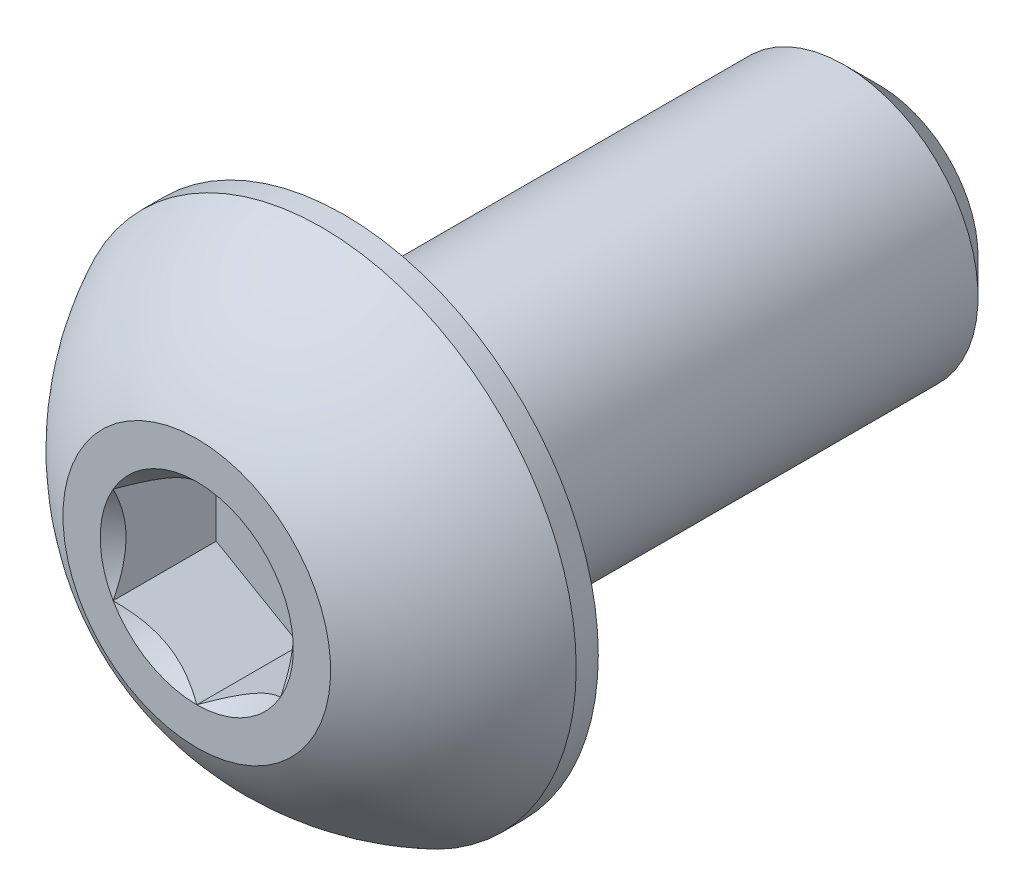
ISO-10303-21;
HEADER;
FILE_DESCRIPTION(('STEP AP214'),'2;1');
FILE_NAME('part.step','',(''),(''),'','','');
FILE_SCHEMA(('AUTOMOTIVE_DESIGN { 1 0 10303 214 1 1 1 1 }'));
ENDSEC;
DATA;
#1=APPLICATION_CONTEXT('core data for automotive mechanical design processes');
#2=APPLICATION_PROTOCOL_DEFINITION('international standard','automotive_design',2000,#1);
#3=PRODUCT_CONTEXT('',#1,'mechanical');
#4=PRODUCT('Part','Part','',(#3));
#5=PRODUCT_RELATED_PRODUCT_CATEGORY('part','',(#4));
#6=PRODUCT_DEFINITION_FORMATION('','',#4);
#7=PRODUCT_DEFINITION_CONTEXT('part definition',#1,'design');
#8=PRODUCT_DEFINITION('design','',#6,#7);
#9=PRODUCT_DEFINITION_SHAPE('','',#8);
#10=(LENGTH_UNIT() NAMED_UNIT(*) SI_UNIT(.MILLI.,.METRE.));
#11=(NAMED_UNIT(*) PLANE_ANGLE_UNIT() SI_UNIT($,.RADIAN.));
#12=(NAMED_UNIT(*) SI_UNIT($,.STERADIAN.) SOLID_ANGLE_UNIT());
#13=UNCERTAINTY_MEASURE_WITH_UNIT(LENGTH_MEASURE(1.E-05),#10,'distance_accuracy_value','');
#14=(GEOMETRIC_REPRESENTATION_CONTEXT(3) GLOBAL_UNCERTAINTY_ASSIGNED_CONTEXT((#13)) GLOBAL_UNIT_ASSIGNED_CONTEXT((#10,
#11,#12)) REPRESENTATION_CONTEXT('',''));
#15=CARTESIAN_POINT('',(0.,0.,0.));
#16=DIRECTION('',(0.,0.,1.));
#17=DIRECTION('',(1.,0.,0.));
#18=AXIS2_PLACEMENT_3D('',#15,#16,#17);
#19=CARTESIAN_POINT('',(0.,-2.,-10.2));
#20=DIRECTION('',(0.,0.,-1.));
#21=DIRECTION('',(0.,1.,0.));
#22=AXIS2_PLACEMENT_3D('',#19,#20,#21);
#23=PLANE('',#22);
#24=CARTESIAN_POINT('',(0.,0.,-10.2));
#25=DIRECTION('',(0.,0.,-1.));
#26=DIRECTION('',(0.,1.,0.));
#27=AXIS2_PLACEMENT_3D('',#24,#25,#26);
#28=CIRCLE('',#27,1.47500000000001);
#29=CARTESIAN_POINT('',(0.,1.47500000000001,-10.2));
#30=VERTEX_POINT('',#29);
#31=EDGE_CURVE('E176',#30,#30,#28,.T.);
#32=ORIENTED_EDGE('',*,*,#31,.T.);
#33=EDGE_LOOP('',(#32));
#34=FACE_BOUND('',#33,.T.);
#35=ADVANCED_FACE('F36',(#34),#23,.T.);
#36=CARTESIAN_POINT('',(0.,0.,-10.2));
#37=DIRECTION('',(0.,0.,-1.));
#38=DIRECTION('',(0.,1.,0.));
#39=AXIS2_PLACEMENT_3D('',#36,#37,#38);
#40=CYLINDRICAL_SURFACE('',#39,2.);
#41=CARTESIAN_POINT('',(0.,0.,-9.675));
#42=DIRECTION('',(0.,0.,-1.));
#43=DIRECTION('',(0.,1.,0.));
#44=AXIS2_PLACEMENT_3D('',#41,#42,#43);
#45=CIRCLE('',#44,2.);
#46=CARTESIAN_POINT('',(0.,2.,-9.675));
#47=VERTEX_POINT('',#46);
#48=EDGE_CURVE('E50',#47,#47,#45,.F.);
#49=ORIENTED_EDGE('',*,*,#48,.T.);
#50=EDGE_LOOP('',(#49));
#51=FACE_BOUND('',#50,.T.);
#52=CARTESIAN_POINT('',(0.,0.,-2.2));
#53=DIRECTION('',(0.,0.,1.));
#54=DIRECTION('',(1.,0.,0.));
#55=AXIS2_PLACEMENT_3D('',#52,#53,#54);
#56=CIRCLE('',#55,2.);
#57=CARTESIAN_POINT('',(2.,0.,-2.2));
#58=VERTEX_POINT('',#57);
#59=EDGE_CURVE('E173',#58,#58,#56,.F.);
#60=ORIENTED_EDGE('',*,*,#59,.T.);
#61=EDGE_LOOP('',(#60));
#62=FACE_BOUND('',#61,.T.);
#63=ADVANCED_FACE('F181',(#51,#62),#40,.T.);
#64=CARTESIAN_POINT('',(0.,0.,-10.2));
#65=DIRECTION('',(0.,0.,1.));
#66=DIRECTION('',(0.,-1.,0.));
#67=AXIS2_PLACEMENT_3D('',#64,#65,#66);
#68=CONICAL_SURFACE('',#67,1.47500000000001,0.785398163397446);
#69=ORIENTED_EDGE('',*,*,#48,.F.);
#70=EDGE_LOOP('',(#69));
#71=FACE_BOUND('',#70,.T.);
#72=ORIENTED_EDGE('',*,*,#31,.F.);
#73=EDGE_LOOP('',(#72));
#74=FACE_BOUND('',#73,.T.);
#75=ADVANCED_FACE('F38',(#71,#74),#68,.T.);
#76=CARTESIAN_POINT('',(0.,0.,-3.72644385026738));
#77=DIRECTION('',(0.,0.,1.));
#78=DIRECTION('',(0.,-1.,0.));
#79=AXIS2_PLACEMENT_3D('',#76,#77,#78);
#80=SPHERICAL_SURFACE('',#79,4.22922968981298);
#81=CARTESIAN_POINT('',(0.,0.,0.));
#82=DIRECTION('',(0.,0.,1.));
#83=DIRECTION('',(1.,0.,0.));
#84=AXIS2_PLACEMENT_3D('',#81,#82,#83);
#85=CIRCLE('',#84,2.);
#86=CARTESIAN_POINT('',(0.,-2.,0.));
#87=VERTEX_POINT('',#86);
#88=EDGE_CURVE('E170',#87,#87,#85,.T.);
#89=CARTESIAN_POINT('',(0.,0.,-1.87));
#90=DIRECTION('',(0.,0.,1.));
#91=DIRECTION('',(1.,0.,0.));
#92=AXIS2_PLACEMENT_3D('',#89,#90,#91);
#93=CIRCLE('',#92,3.8);
#94=CARTESIAN_POINT('',(0.,-3.8,-1.87));
#95=VERTEX_POINT('',#94);
#96=EDGE_CURVE('E164',#95,#95,#93,.T.);
#97=CARTESIAN_POINT('',(0.,-2.,0.));
#98=CARTESIAN_POINT('',(0.,-2.02421343985614,-0.0129954259644867));
#99=CARTESIAN_POINT('',(0.,-2.04830018323974,-0.0262269129651297));
#100=CARTESIAN_POINT('',(0.,-2.09621120342126,-0.0531568415057491));
#101=CARTESIAN_POINT('',(0.,-2.12003548021917,-0.0668552830457256));
#102=CARTESIAN_POINT('',(0.,-2.16741249358867,-0.0947139531320317));
#103=CARTESIAN_POINT('',(0.,-2.19096523016026,-0.108874181678361));
#104=CARTESIAN_POINT('',(0.,-2.23779021933683,-0.137651035235956));
#105=CARTESIAN_POINT('',(0.,-2.26106247194181,-0.152267660247221));
#106=CARTESIAN_POINT('',(0.,-2.30731764886072,-0.181951755514141));
#107=CARTESIAN_POINT('',(0.,-2.33030057317465,-0.197019225769795));
#108=CARTESIAN_POINT('',(0.,-2.37596836104235,-0.227599285582871));
#109=CARTESIAN_POINT('',(0.,-2.39865322459612,-0.243111875140292));
#110=CARTESIAN_POINT('',(0.,-2.44371627121513,-0.274576279395883));
#111=CARTESIAN_POINT('',(0.,-2.46609445428038,-0.290528094094053));
#112=CARTESIAN_POINT('',(0.,-2.51053563686181,-0.322864887331672));
#113=CARTESIAN_POINT('',(0.,-2.53259863637801,-0.339249865871121));
#114=CARTESIAN_POINT('',(0.,-2.57640106852492,-0.372446760967231));
#115=CARTESIAN_POINT('',(0.,-2.59814050115564,-0.389258677523892));
#116=CARTESIAN_POINT('',(0.,-2.64128753915154,-0.423303060588148));
#117=CARTESIAN_POINT('',(0.,-2.66269514451671,-0.440535527095742));
#118=CARTESIAN_POINT('',(0.,-2.70517039368395,-0.475414462202967));
#119=CARTESIAN_POINT('',(0.,-2.72623803748602,-0.493060930802597));
#120=CARTESIAN_POINT('',(0.,-2.76802535840619,-0.528761164924409));
#121=CARTESIAN_POINT('',(0.,-2.78874503552428,-0.54681493044659));
#122=CARTESIAN_POINT('',(0.,-2.82982855017313,-0.583322898482807));
#123=CARTESIAN_POINT('',(0.,-2.85019238770389,-0.601777100996844));
#124=CARTESIAN_POINT('',(0.,-2.89055648548394,-0.639078930931023));
#125=CARTESIAN_POINT('',(0.,-2.91055674573324,-0.657926558351165));
#126=CARTESIAN_POINT('',(0.,-2.95018608940553,-0.696008076521266));
#127=CARTESIAN_POINT('',(0.,-2.96981517282852,-0.715241967271225));
#128=CARTESIAN_POINT('',(0.,-3.00869470434027,-0.754088703755295));
#129=CARTESIAN_POINT('',(0.,-3.02794515242903,-0.773701549489406));
#130=CARTESIAN_POINT('',(0.,-3.06606009863533,-0.813298743603726));
#131=CARTESIAN_POINT('',(0.,-3.08492459675287,-0.833283091983934));
#132=CARTESIAN_POINT('',(0.,-3.12226047503003,-0.873615697891678));
#133=CARTESIAN_POINT('',(0.,-3.14073185518965,-0.893963955419212));
#134=CARTESIAN_POINT('',(0.,-3.17727447893821,-0.935016647847443));
#135=CARTESIAN_POINT('',(0.,-3.19534572252716,-0.955721082748139));
#136=CARTESIAN_POINT('',(0.,-3.23108120656242,-0.997478262810989));
#137=CARTESIAN_POINT('',(0.,-3.24874544700875,-1.01853100797314));
#138=CARTESIAN_POINT('',(0.,-3.28366021283673,-1.06097680909897));
#139=CARTESIAN_POINT('',(0.,-3.30091073821839,-1.08236986506264));
#140=CARTESIAN_POINT('',(0.,-3.33499151919534,-1.12548815902283));
#141=CARTESIAN_POINT('',(0.,-3.35182177479064,-1.14721339701936));
#142=CARTESIAN_POINT('',(0.,-3.38505562116371,-1.1909878000568));
#143=CARTESIAN_POINT('',(0.,-3.40145921194149,-1.21303696509771));
#144=CARTESIAN_POINT('',(0.,-3.43383349577047,-1.25745084415152));
#145=CARTESIAN_POINT('',(0.,-3.44980418882166,-1.27981555816441));
#146=CARTESIAN_POINT('',(0.,-3.48130660877275,-1.32485203719233));
#147=CARTESIAN_POINT('',(0.,-3.49683833567264,-1.34752380220736));
#148=CARTESIAN_POINT('',(0.,-3.52745692170931,-1.39316576858967));
#149=CARTESIAN_POINT('',(0.,-3.5425437808461,-1.41613596995694));
#150=CARTESIAN_POINT('',(0.,-3.57226689871518,-1.46236608103065));
#151=CARTESIAN_POINT('',(0.,-3.58690315744748,-1.48562599073709));
#152=CARTESIAN_POINT('',(0.,-3.61571951333199,-1.5324266802666));
#153=CARTESIAN_POINT('',(0.,-3.62989961048422,-1.55596746008967));
#154=CARTESIAN_POINT('',(0.,-3.65779825442823,-1.6033209453859));
#155=CARTESIAN_POINT('',(0.,-3.67151680122002,-1.62713365085906));
#156=CARTESIAN_POINT('',(0.,-3.69848713452322,-1.67502193787766));
#157=CARTESIAN_POINT('',(0.,-3.71173892103462,-1.6990975194231));
#158=CARTESIAN_POINT('',(0.,-3.73777068821038,-1.74750241579215));
#159=CARTESIAN_POINT('',(0.,-3.75055066887474,-1.77183173061575));
#160=CARTESIAN_POINT('',(0.,-3.77563400658954,-1.82073482944519));
#161=CARTESIAN_POINT('',(0.,-3.78793736363997,-1.84530861345103));
#162=CARTESIAN_POINT('',(0.,-3.8,-1.87));
#163=B_SPLINE_CURVE_WITH_KNOTS('',3,(#97,#98,#99,#100,#101,#102,#103,#104,#105,#106,#107,#108,
#109,#110,#111,#112,#113,#114,#115,#116,#117,#118,#119,#120,#121,#122,#123,#124,#125,#126,#127,
#128,#129,#130,#131,#132,#133,#134,#135,#136,#137,#138,#139,#140,#141,#142,#143,#144,#145,#146,
#147,#148,#149,#150,#151,#152,#153,#154,#155,#156,#157,#158,#159,#160,#161,#162),.UNSPECIFIED.,
.F.,.F.,(4,2,2,2,2,2,2,2,2,2,2,2,2,2,2,2,2,2,2,2,2,2,2,2,2,2,2,2,2,2,2,2,4),(0.,
0.082439858910264,0.164879717820529,0.247319576730793,0.329759435641057,0.412199294551321,
0.494639153461585,0.57707901237185,0.659518871282114,0.741958730192378,0.824398589102642,
0.906838448012906,0.989278306923171,1.07171816583344,1.1541580247437,1.23659788365396,
1.31903774256423,1.40147760147449,1.48391746038476,1.56635731929502,1.64879717820529,
1.73123703711555,1.81367689602581,1.89611675493608,1.97855661384634,2.06099647275661,
2.14343633166687,2.22587619057713,2.3083160494874,2.39075590839766,2.47319576730793,
2.55563562621819,2.63807548512846),.UNSPECIFIED.);
#164=EDGE_CURVE('BSEAM186',#87,#95,#163,.T.);
#165=ORIENTED_EDGE('',*,*,#88,.F.);
#166=ORIENTED_EDGE('',*,*,#96,.T.);
#167=ORIENTED_EDGE('',*,*,#164,.T.);
#168=ORIENTED_EDGE('',*,*,#164,.F.);
#169=EDGE_LOOP('',(#165,#167,#166,#168));
#170=FACE_BOUND('',#169,.T.);
#171=ADVANCED_FACE('F186',(#170),#80,.T.);
#172=CARTESIAN_POINT('',(0.,-2.,0.));
#173=DIRECTION('',(0.,0.,-1.));
#174=DIRECTION('',(-1.,0.,0.));
#175=AXIS2_PLACEMENT_3D('',#172,#173,#174);
#176=PLANE('',#175);
#177=CARTESIAN_POINT('',(0.,0.,0.));
#178=DIRECTION('',(0.,0.,1.));
#179=DIRECTION('',(1.,0.,0.));
#180=AXIS2_PLACEMENT_3D('',#177,#178,#179);
#181=CIRCLE('',#180,1.44337567297406);
#182=CARTESIAN_POINT('',(-1.25,0.721687836487032,0.));
#183=VERTEX_POINT('',#182);
#184=CARTESIAN_POINT('',(-1.25,-0.721687836487032,0.));
#185=VERTEX_POINT('',#184);
#186=EDGE_CURVE('E63',#183,#185,#181,.T.);
#187=ORIENTED_EDGE('',*,*,#186,.F.);
#188=CARTESIAN_POINT('',(0.,1.44337567297406,0.));
#189=VERTEX_POINT('',#188);
#190=EDGE_CURVE('E135',#189,#183,#181,.T.);
#191=ORIENTED_EDGE('',*,*,#190,.F.);
#192=CARTESIAN_POINT('',(1.25,0.72168783648703,0.));
#193=VERTEX_POINT('',#192);
#194=EDGE_CURVE('E132',#193,#189,#181,.T.);
#195=ORIENTED_EDGE('',*,*,#194,.F.);
#196=CARTESIAN_POINT('',(1.25,-0.721687836487029,0.));
#197=VERTEX_POINT('',#196);
#198=EDGE_CURVE('E103',#197,#193,#181,.T.);
#199=ORIENTED_EDGE('',*,*,#198,.F.);
#200=CARTESIAN_POINT('',(0.,-1.44337567297406,0.));
#201=VERTEX_POINT('',#200);
#202=EDGE_CURVE('E95',#201,#197,#181,.T.);
#203=ORIENTED_EDGE('',*,*,#202,.F.);
#204=EDGE_CURVE('E56',#185,#201,#181,.T.);
#205=ORIENTED_EDGE('',*,*,#204,.F.);
#206=EDGE_LOOP('',(#187,#191,#195,#199,#203,#205));
#207=FACE_BOUND('',#206,.T.);
#208=ORIENTED_EDGE('',*,*,#88,.T.);
#209=EDGE_LOOP('',(#208));
#210=FACE_BOUND('',#209,.T.);
#211=ADVANCED_FACE('F129',(#207,#210),#176,.F.);
#212=CARTESIAN_POINT('',(0.,-3.8,-2.2));
#213=DIRECTION('',(0.,0.,1.));
#214=DIRECTION('',(1.,0.,0.));
#215=AXIS2_PLACEMENT_3D('',#212,#213,#214);
#216=PLANE('',#215);
#217=ORIENTED_EDGE('',*,*,#59,.F.);
#218=EDGE_LOOP('',(#217));
#219=FACE_BOUND('',#218,.T.);
#220=CARTESIAN_POINT('',(0.,0.,-2.2));
#221=DIRECTION('',(0.,0.,1.));
#222=DIRECTION('',(1.,0.,0.));
#223=AXIS2_PLACEMENT_3D('',#220,#221,#222);
#224=CIRCLE('',#223,3.8);
#225=CARTESIAN_POINT('',(3.8,0.,-2.2));
#226=VERTEX_POINT('',#225);
#227=EDGE_CURVE('E167',#226,#226,#224,.T.);
#228=ORIENTED_EDGE('',*,*,#227,.F.);
#229=EDGE_LOOP('',(#228));
#230=FACE_BOUND('',#229,.T.);
#231=ADVANCED_FACE('F200',(#219,#230),#216,.F.);
#232=CARTESIAN_POINT('',(0.,0.,0.));
#233=DIRECTION('',(0.,0.,1.));
#234=DIRECTION('',(1.,0.,0.));
#235=AXIS2_PLACEMENT_3D('',#232,#233,#234);
#236=CYLINDRICAL_SURFACE('',#235,3.8);
#237=ORIENTED_EDGE('',*,*,#96,.F.);
#238=EDGE_LOOP('',(#237));
#239=FACE_BOUND('',#238,.T.);
#240=ORIENTED_EDGE('',*,*,#227,.T.);
#241=EDGE_LOOP('',(#240));
#242=FACE_BOUND('',#241,.T.);
#243=ADVANCED_FACE('F203',(#239,#242),#236,.T.);
#244=CARTESIAN_POINT('',(0.,0.,0.));
#245=DIRECTION('',(0.,0.,1.));
#246=DIRECTION('',(1.,0.,0.));
#247=AXIS2_PLACEMENT_3D('',#244,#245,#246);
#248=CONICAL_SURFACE('',#247,1.44337567297406,0.78539816339745);
#249=ORIENTED_EDGE('',*,*,#198,.T.);
#250=CARTESIAN_POINT('',(1.25,-1.43934010829018,0.462982097050438));
#251=CARTESIAN_POINT('',(1.25,-1.40429313026012,0.436524922784911));
#252=CARTESIAN_POINT('',(1.25,-1.36905087155363,0.41032716050022));
#253=CARTESIAN_POINT('',(1.25,-1.2980965072489,0.3585575719734));
#254=CARTESIAN_POINT('',(1.25,-1.26238428594479,0.332985904484065));
#255=CARTESIAN_POINT('',(1.25,-1.1539011180887,0.257005993798984));
#256=CARTESIAN_POINT('',(1.25,-1.08031646741187,0.207740286286972));
#257=CARTESIAN_POINT('',(1.25,-0.926012322877299,0.111025830335616));
#258=CARTESIAN_POINT('',(1.25,-0.845125318763645,0.0638412990015671));
#259=CARTESIAN_POINT('',(1.25,-0.679311174153441,-0.0224692655733852));
#260=CARTESIAN_POINT('',(1.25,-0.594398891087582,-0.06162246534777));
#261=CARTESIAN_POINT('',(1.25,-0.466944812509638,-0.109522776294448));
#262=CARTESIAN_POINT('',(1.25,-0.426289985866743,-0.123270510196088));
#263=CARTESIAN_POINT('',(1.25,-0.343998850155401,-0.147502072532269));
#264=CARTESIAN_POINT('',(1.25,-0.302362473684284,-0.157985676113741));
#265=CARTESIAN_POINT('',(1.25,-0.219052696365193,-0.174969838237796));
#266=CARTESIAN_POINT('',(1.25,-0.177393428559043,-0.181538639516573));
#267=CARTESIAN_POINT('',(1.25,-0.0936293694345968,-0.190564946535011));
#268=CARTESIAN_POINT('',(1.25,-0.0515246559536477,-0.193023158998483));
#269=CARTESIAN_POINT('',(1.25,0.0311890575224398,-0.193645937989274));
#270=CARTESIAN_POINT('',(1.25,0.071796962437633,-0.191962883160082));
#271=CARTESIAN_POINT('',(1.25,0.152668636765094,-0.18473172941654));
#272=CARTESIAN_POINT('',(1.25,0.192932338711555,-0.179182889605702));
#273=CARTESIAN_POINT('',(1.25,0.273499879034189,-0.164428963562988));
#274=CARTESIAN_POINT('',(1.25,0.313792180483815,-0.155161824068638));
#275=CARTESIAN_POINT('',(1.25,0.393496413769926,-0.133463821585106));
#276=CARTESIAN_POINT('',(1.25,0.432908418970283,-0.121033223316716));
#277=CARTESIAN_POINT('',(1.25,0.556992735685998,-0.0772206471390584));
#278=CARTESIAN_POINT('',(1.25,0.639898924463084,-0.0408489272158251));
#279=CARTESIAN_POINT('',(1.25,0.801816555245349,0.0400191620416379));
#280=CARTESIAN_POINT('',(1.25,0.880812666046054,0.0845447207516417));
#281=CARTESIAN_POINT('',(1.25,1.03178561247421,0.176404876461019));
#282=CARTESIAN_POINT('',(1.25,1.10391618450775,0.223489933689236));
#283=CARTESIAN_POINT('',(1.25,1.2101860600607,0.296278561339524));
#284=CARTESIAN_POINT('',(1.25,1.24515069931176,0.320798085123763));
#285=CARTESIAN_POINT('',(1.25,1.31460220812614,0.370485636474934));
#286=CARTESIAN_POINT('',(1.25,1.3490892055554,0.395653485114204));
#287=CARTESIAN_POINT('',(1.25,1.38337731640879,0.421090148529342));
#288=B_SPLINE_CURVE_WITH_KNOTS('',3,(#250,#251,#252,#253,#254,#255,#256,#257,#258,#259,#260,
#261,#262,#263,#264,#265,#266,#267,#268,#269,#270,#271,#272,#273,#274,#275,#276,#277,#278,#279,
#280,#281,#282,#283,#284,#285,#286,#287),.UNSPECIFIED.,.F.,.F.,(4,2,2,2,2,2,2,2,2,2,2,2,2,2,2,2,
2,2,4),(0.,0.131732960406522,0.263498984211799,0.529042014557079,0.809741926293175,
1.08947609738757,1.21811634292655,1.34676544802529,1.47310084535081,1.59941451989631,
1.72115042182423,1.84290966145033,1.96679153917268,2.09066305376594,2.36146692896707,
2.63325989189266,2.89154668194564,3.01965734485811,3.14773302219539),.UNSPECIFIED.);
#289=EDGE_CURVE('E11',#197,#193,#288,.T.);
#290=ORIENTED_EDGE('',*,*,#289,.F.);
#291=EDGE_LOOP('',(#249,#290));
#292=FACE_BOUND('',#291,.T.);
#293=ADVANCED_FACE('F107',(#292),#248,.F.);
#294=ORIENTED_EDGE('',*,*,#194,.T.);
#295=CARTESIAN_POINT('',(1.2502,0.721572366433193,0.000115483909136456));
#296=CARTESIAN_POINT('',(1.20722483292841,0.746384090710443,-0.0246783319448958));
#297=CARTESIAN_POINT('',(1.16353099525405,0.771610739653664,-0.048016265581316));
#298=CARTESIAN_POINT('',(1.07443406915806,0.823050873919154,-0.0907479959154631));
#299=CARTESIAN_POINT('',(1.02902250164294,0.849269254648332,-0.110118007639586));
#300=CARTESIAN_POINT('',(0.93745217906474,0.902137405038634,-0.143299516586523));
#301=CARTESIAN_POINT('',(0.891316759824114,0.928773701756386,-0.157194440947344));
#302=CARTESIAN_POINT('',(0.798029919592407,0.982632884076012,-0.178602717839361));
#303=CARTESIAN_POINT('',(0.75088135086362,1.00985412292348,-0.186132058433213));
#304=CARTESIAN_POINT('',(0.669626443112747,1.05676666578643,-0.192925501949297));
#305=CARTESIAN_POINT('',(0.635625123372059,1.07639733689152,-0.19393144089565));
#306=CARTESIAN_POINT('',(0.567682235567522,1.11562418145499,-0.192238585088681));
#307=CARTESIAN_POINT('',(0.533740682344342,1.1352203463451,-0.189538972784462));
#308=CARTESIAN_POINT('',(0.4661851435425,1.1742235548576,-0.180591069683623));
#309=CARTESIAN_POINT('',(0.432571492713225,1.19363040521232,-0.174339474100294));
#310=CARTESIAN_POINT('',(0.365905361782187,1.23212011385119,-0.158624318586096));
#311=CARTESIAN_POINT('',(0.332853128969704,1.25120282936279,-0.149159379912542));
#312=CARTESIAN_POINT('',(0.248200308399735,1.30007715810653,-0.121068609312414));
#313=CARTESIAN_POINT('',(0.197133507570362,1.32956058931202,-0.1003298425478));
#314=CARTESIAN_POINT('',(0.0969991458867449,1.38737318998519,-0.053612865328524));
#315=CARTESIAN_POINT('',(0.0479256884217303,1.41570576386268,-0.0276517040532342));
#316=CARTESIAN_POINT('',(-0.000200000000000284,1.4434911430279,0.000115483909135606));
#317=B_SPLINE_CURVE_WITH_KNOTS('',3,(#295,#296,#297,#298,#299,#300,#301,#302,#303,#304,#305,
#306,#307,#308,#309,#310,#311,#312,#313,#314,#315,#316),.UNSPECIFIED.,.F.,.F.,(4,2,2,2,2,2,2,2,
2,2,4),(0.,0.166533409618304,0.334037607289762,0.498880396489698,0.663307919240275,
0.780963963458827,0.898645970148453,1.01643764860773,1.13427993171549,1.32148652032141,
1.50809158792574),.UNSPECIFIED.);
#318=EDGE_CURVE('E134',#193,#189,#317,.T.);
#319=ORIENTED_EDGE('',*,*,#318,.F.);
#320=EDGE_LOOP('',(#294,#319));
#321=FACE_BOUND('',#320,.T.);
#322=ADVANCED_FACE('F288',(#321),#248,.F.);
#323=ORIENTED_EDGE('',*,*,#190,.T.);
#324=CARTESIAN_POINT('',(0.000199999999999553,1.4434911430279,0.000115483909135892));
#325=CARTESIAN_POINT('',(-0.0427751670715871,1.41867941875065,-0.0246783319448966));
#326=CARTESIAN_POINT('',(-0.0864690047459484,1.39345276980743,-0.0480162655813167));
#327=CARTESIAN_POINT('',(-0.175565930841942,1.34201263554194,-0.0907479959154634));
#328=CARTESIAN_POINT('',(-0.220977498357064,1.31579425481276,-0.110118007639586));
#329=CARTESIAN_POINT('',(-0.31254782093526,1.26292610442246,-0.143299516586523));
#330=CARTESIAN_POINT('',(-0.358683240175886,1.23628980770471,-0.157194440947344));
#331=CARTESIAN_POINT('',(-0.451970080407592,1.18243062538508,-0.178602717839361));
#332=CARTESIAN_POINT('',(-0.499118649136379,1.15520938653761,-0.186132058433213));
#333=CARTESIAN_POINT('',(-0.580373556887252,1.10829684367467,-0.192925501949297));
#334=CARTESIAN_POINT('',(-0.61437487662794,1.08866617256958,-0.19393144089565));
#335=CARTESIAN_POINT('',(-0.682317764432477,1.04943932800611,-0.192238585088681));
#336=CARTESIAN_POINT('',(-0.716259317655657,1.02984316311599,-0.189538972784462));
#337=CARTESIAN_POINT('',(-0.783814856457499,0.990839954603498,-0.180591069683623));
#338=CARTESIAN_POINT('',(-0.817428507286774,0.97143310424877,-0.174339474100294));
#339=CARTESIAN_POINT('',(-0.884094638217813,0.932943395609904,-0.158624318586096));
#340=CARTESIAN_POINT('',(-0.917146871030295,0.9138606800983,-0.149159379912542));
#341=CARTESIAN_POINT('',(-1.00179969160026,0.864986351354567,-0.121068609312414));
#342=CARTESIAN_POINT('',(-1.05286649242964,0.835502920149075,-0.100329842547799));
#343=CARTESIAN_POINT('',(-1.15300085411325,0.777690319475908,-0.0536128653285238));
#344=CARTESIAN_POINT('',(-1.20207431157827,0.749357745598416,-0.0276517040532341));
#345=CARTESIAN_POINT('',(-1.2502,0.721572366433194,0.000115483909135703));
#346=B_SPLINE_CURVE_WITH_KNOTS('',3,(#324,#325,#326,#327,#328,#329,#330,#331,#332,#333,#334,
#335,#336,#337,#338,#339,#340,#341,#342,#343,#344,#345),.UNSPECIFIED.,.F.,.F.,(4,2,2,2,2,2,2,2,
2,2,4),(0.,0.166533409618303,0.334037607289761,0.498880396489697,0.663307919240273,
0.780963963458825,0.898645970148452,1.01643764860773,1.13427993171549,1.32148652032141,
1.50809158792573),.UNSPECIFIED.);
#347=EDGE_CURVE('E139',#189,#183,#346,.T.);
#348=ORIENTED_EDGE('',*,*,#347,.F.);
#349=EDGE_LOOP('',(#323,#348));
#350=FACE_BOUND('',#349,.T.);
#351=ADVANCED_FACE('F142',(#350),#248,.F.);
#352=ORIENTED_EDGE('',*,*,#186,.T.);
#353=CARTESIAN_POINT('',(-1.25,-1.43934010808077,0.462982096892325));
#354=CARTESIAN_POINT('',(-1.25,-1.40429313005658,0.436524922632888));
#355=CARTESIAN_POINT('',(-1.25,-1.36905087135599,0.410327160354278));
#356=CARTESIAN_POINT('',(-1.25,-1.29809650706311,0.358557571839583));
#357=CARTESIAN_POINT('',(-1.25,-1.26238428576495,0.332985904356292));
#358=CARTESIAN_POINT('',(-1.25,-1.15390111792708,0.257005993689463));
#359=CARTESIAN_POINT('',(-1.25,-1.08031646726264,0.207740286189565));
#360=CARTESIAN_POINT('',(-1.25,-0.926012322755094,0.111025830263131));
#361=CARTESIAN_POINT('',(-1.25,-0.845125318656145,0.0638412989417955));
#362=CARTESIAN_POINT('',(-1.25,-0.679311174076601,-0.0224692656095873));
#363=CARTESIAN_POINT('',(-1.25,-0.594398891026687,-0.0616224653731003));
#364=CARTESIAN_POINT('',(-1.25,-0.46694481246074,-0.109522776311708));
#365=CARTESIAN_POINT('',(-1.25,-0.426289985812821,-0.123270510213664));
#366=CARTESIAN_POINT('',(-1.25,-0.343998850091267,-0.147502072549458));
#367=CARTESIAN_POINT('',(-1.25,-0.302362473614962,-0.157985676130228));
#368=CARTESIAN_POINT('',(-1.25,-0.219052696285665,-0.174969838251703));
#369=CARTESIAN_POINT('',(-1.25,-0.1773934284745,-0.181538639528632));
#370=CARTESIAN_POINT('',(-1.25,-0.0936293693401921,-0.190564946542241));
#371=CARTESIAN_POINT('',(-1.25,-0.051524655854396,-0.193023159002732));
#372=CARTESIAN_POINT('',(-1.25,0.0311890576306315,-0.193645937986716));
#373=CARTESIAN_POINT('',(-1.25,0.0717969625499303,-0.191962883153754));
#374=CARTESIAN_POINT('',(-1.25,0.152668636885197,-0.184731729402087));
#375=CARTESIAN_POINT('',(-1.25,0.192932338835358,-0.179182889586893));
#376=CARTESIAN_POINT('',(-1.25,0.273499879165295,-0.164428963535047));
#377=CARTESIAN_POINT('',(-1.25,0.313792180618511,-0.155161824035895));
#378=CARTESIAN_POINT('',(-1.25,0.393496413911457,-0.133463821542654));
#379=CARTESIAN_POINT('',(-1.25,0.432908419115058,-0.121033223269356));
#380=CARTESIAN_POINT('',(-1.25,0.556992735862297,-0.0772206470685635));
#381=CARTESIAN_POINT('',(-1.25,0.639898924666084,-0.0408489271240447));
#382=CARTESIAN_POINT('',(-1.25,0.8018165554997,0.0400191621783341));
#383=CARTESIAN_POINT('',(-1.25,0.880812666325043,0.0845447209119849));
#384=CARTESIAN_POINT('',(-1.25,1.0317856127975,0.176404876666624));
#385=CARTESIAN_POINT('',(-1.25,1.10391618485086,0.223489933916248));
#386=CARTESIAN_POINT('',(-1.25,1.2101860604331,0.296278561598537));
#387=CARTESIAN_POINT('',(-1.25,1.24515069969379,0.320798085393357));
#388=CARTESIAN_POINT('',(-1.25,1.31460220852736,0.370485636765679));
#389=CARTESIAN_POINT('',(-1.25,1.34908920596618,0.395653485415518));
#390=CARTESIAN_POINT('',(-1.25,1.38337731682911,0.421090148841212));
#391=B_SPLINE_CURVE_WITH_KNOTS('',3,(#353,#354,#355,#356,#357,#358,#359,#360,#361,#362,#363,
#364,#365,#366,#367,#368,#369,#370,#371,#372,#373,#374,#375,#376,#377,#378,#379,#380,#381,#382,
#383,#384,#385,#386,#387,#388,#389,#390),.UNSPECIFIED.,.F.,.F.,(4,2,2,2,2,2,2,2,2,2,2,2,2,2,2,2,
2,2,4),(0.,0.131732960381448,0.263498984161644,0.529042014455825,0.809741926134617,
1.08947609717225,1.21811634272576,1.346765447839,1.47310084517844,1.59941451973784,
1.72115042167849,1.84290966131735,1.96679153905341,2.09066305366039,2.36146692896009,
2.63325989198491,2.89154668212279,3.01965734507712,3.14773302245628),.UNSPECIFIED.);
#392=EDGE_CURVE('E146',#183,#185,#391,.F.);
#393=ORIENTED_EDGE('',*,*,#392,.F.);
#394=EDGE_LOOP('',(#352,#393));
#395=FACE_BOUND('',#394,.T.);
#396=ADVANCED_FACE('F282',(#395),#248,.F.);
#397=ORIENTED_EDGE('',*,*,#204,.T.);
#398=CARTESIAN_POINT('',(-1.2502,-0.721572366433194,0.000115483909135587));
#399=CARTESIAN_POINT('',(-1.20722483292841,-0.746384090710444,-0.0246783319448968));
#400=CARTESIAN_POINT('',(-1.16353099525405,-0.771610739653664,-0.048016265581317));
#401=CARTESIAN_POINT('',(-1.07443406915806,-0.823050873919154,-0.0907479959154639));
#402=CARTESIAN_POINT('',(-1.02902250164293,-0.849269254648333,-0.110118007639587));
#403=CARTESIAN_POINT('',(-0.937452179064739,-0.902137405038635,-0.143299516586523));
#404=CARTESIAN_POINT('',(-0.891316759824113,-0.928773701756386,-0.157194440947344));
#405=CARTESIAN_POINT('',(-0.798029919592406,-0.982632884076012,-0.178602717839361));
#406=CARTESIAN_POINT('',(-0.750881350863619,-1.00985412292348,-0.186132058433213));
#407=CARTESIAN_POINT('',(-0.669626443112747,-1.05676666578643,-0.192925501949297));
#408=CARTESIAN_POINT('',(-0.635625123372058,-1.07639733689152,-0.193931440895651));
#409=CARTESIAN_POINT('',(-0.567682235567522,-1.11562418145499,-0.192238585088682));
#410=CARTESIAN_POINT('',(-0.533740682344342,-1.1352203463451,-0.189538972784462));
#411=CARTESIAN_POINT('',(-0.4661851435425,-1.1742235548576,-0.180591069683623));
#412=CARTESIAN_POINT('',(-0.432571492713225,-1.19363040521232,-0.174339474100294));
#413=CARTESIAN_POINT('',(-0.365905361782187,-1.23212011385119,-0.158624318586096));
#414=CARTESIAN_POINT('',(-0.332853128969704,-1.25120282936279,-0.149159379912542));
#415=CARTESIAN_POINT('',(-0.248200308399735,-1.30007715810653,-0.121068609312415));
#416=CARTESIAN_POINT('',(-0.197133507570361,-1.32956058931202,-0.1003298425478));
#417=CARTESIAN_POINT('',(-0.0969991458867449,-1.38737318998519,-0.0536128653285241));
#418=CARTESIAN_POINT('',(-0.0479256884217304,-1.41570576386268,-0.0276517040532342));
#419=CARTESIAN_POINT('',(0.000200000000000203,-1.4434911430279,0.000115483909135674));
#420=B_SPLINE_CURVE_WITH_KNOTS('',3,(#398,#399,#400,#401,#402,#403,#404,#405,#406,#407,#408,
#409,#410,#411,#412,#413,#414,#415,#416,#417,#418,#419),.UNSPECIFIED.,.F.,.F.,(4,2,2,2,2,2,2,2,
2,2,4),(0.,0.166533409618303,0.334037607289761,0.498880396489697,0.663307919240274,
0.780963963458826,0.898645970148452,1.01643764860773,1.13427993171549,1.32148652032141,
1.50809158792573),.UNSPECIFIED.);
#421=EDGE_CURVE('E119',#185,#201,#420,.T.);
#422=ORIENTED_EDGE('',*,*,#421,.F.);
#423=EDGE_LOOP('',(#397,#422));
#424=FACE_BOUND('',#423,.T.);
#425=ADVANCED_FACE('F230',(#424),#248,.F.);
#426=ORIENTED_EDGE('',*,*,#202,.T.);
#427=CARTESIAN_POINT('',(-0.000199999999999765,-1.4434911430279,0.000115483909135675));
#428=CARTESIAN_POINT('',(0.0427751670715869,-1.41867941875065,-0.0246783319448967));
#429=CARTESIAN_POINT('',(0.0864690047459481,-1.39345276980743,-0.0480162655813168));
#430=CARTESIAN_POINT('',(0.175565930841942,-1.34201263554194,-0.0907479959154637));
#431=CARTESIAN_POINT('',(0.220977498357064,-1.31579425481276,-0.110118007639586));
#432=CARTESIAN_POINT('',(0.31254782093526,-1.26292610442246,-0.143299516586523));
#433=CARTESIAN_POINT('',(0.358683240175885,-1.23628980770471,-0.157194440947345));
#434=CARTESIAN_POINT('',(0.451970080407592,-1.18243062538508,-0.178602717839362));
#435=CARTESIAN_POINT('',(0.499118649136379,-1.15520938653761,-0.186132058433214));
#436=CARTESIAN_POINT('',(0.580373556887252,-1.10829684367467,-0.192925501949297));
#437=CARTESIAN_POINT('',(0.61437487662794,-1.08866617256958,-0.19393144089565));
#438=CARTESIAN_POINT('',(0.682317764432476,-1.04943932800611,-0.192238585088681));
#439=CARTESIAN_POINT('',(0.716259317655656,-1.02984316311599,-0.189538972784462));
#440=CARTESIAN_POINT('',(0.783814856457498,-0.990839954603498,-0.180591069683623));
#441=CARTESIAN_POINT('',(0.817428507286774,-0.97143310424877,-0.174339474100295));
#442=CARTESIAN_POINT('',(0.884094638217812,-0.932943395609904,-0.158624318586096));
#443=CARTESIAN_POINT('',(0.917146871030294,-0.913860680098299,-0.149159379912542));
#444=CARTESIAN_POINT('',(1.00179969160026,-0.864986351354566,-0.121068609312415));
#445=CARTESIAN_POINT('',(1.05286649242964,-0.835502920149074,-0.1003298425478));
#446=CARTESIAN_POINT('',(1.15300085411325,-0.777690319475907,-0.053612865328524));
#447=CARTESIAN_POINT('',(1.20207431157827,-0.749357745598415,-0.027651704053234));
#448=CARTESIAN_POINT('',(1.2502,-0.721572366433193,0.000115483909136134));
#449=B_SPLINE_CURVE_WITH_KNOTS('',3,(#427,#428,#429,#430,#431,#432,#433,#434,#435,#436,#437,
#438,#439,#440,#441,#442,#443,#444,#445,#446,#447,#448),.UNSPECIFIED.,.F.,.F.,(4,2,2,2,2,2,2,2,
2,2,4),(0.,0.166533409618303,0.334037607289761,0.498880396489697,0.663307919240273,
0.780963963458825,0.898645970148451,1.01643764860773,1.13427993171549,1.32148652032141,
1.50809158792574),.UNSPECIFIED.);
#450=EDGE_CURVE('E99',#201,#197,#449,.T.);
#451=ORIENTED_EDGE('',*,*,#450,.F.);
#452=EDGE_LOOP('',(#426,#451));
#453=FACE_BOUND('',#452,.T.);
#454=ADVANCED_FACE('F97',(#453),#248,.F.);
#455=CARTESIAN_POINT('',(1.25,-0.72168783648703,-1.54));
#456=DIRECTION('',(0.,0.,1.));
#457=DIRECTION('',(1.,0.,0.));
#458=AXIS2_PLACEMENT_3D('',#455,#456,#457);
#459=PLANE('',#458);
#460=DIRECTION('',(0.866025403784438,0.5,0.));
#461=VECTOR('',#460,1.);
#462=CARTESIAN_POINT('',(0.,-1.44337567297406,-1.54));
#463=LINE('',#462,#461);
#464=CARTESIAN_POINT('',(0.,-1.44337567297406,-1.54));
#465=VERTEX_POINT('',#464);
#466=CARTESIAN_POINT('',(1.25,-0.72168783648703,-1.54));
#467=VERTEX_POINT('',#466);
#468=EDGE_CURVE('E118',#465,#467,#463,.T.);
#469=ORIENTED_EDGE('',*,*,#468,.T.);
#470=DIRECTION('',(0.,1.,0.));
#471=VECTOR('',#470,1.);
#472=CARTESIAN_POINT('',(1.25,-0.72168783648703,-1.54));
#473=LINE('',#472,#471);
#474=CARTESIAN_POINT('',(1.25,0.721687836487031,-1.54));
#475=VERTEX_POINT('',#474);
#476=EDGE_CURVE('E123',#467,#475,#473,.T.);
#477=ORIENTED_EDGE('',*,*,#476,.T.);
#478=DIRECTION('',(-0.866025403784439,0.5,0.));
#479=VECTOR('',#478,1.);
#480=CARTESIAN_POINT('',(1.25,0.721687836487031,-1.54));
#481=LINE('',#480,#479);
#482=CARTESIAN_POINT('',(0.,1.44337567297406,-1.54));
#483=VERTEX_POINT('',#482);
#484=EDGE_CURVE('E272',#475,#483,#481,.T.);
#485=ORIENTED_EDGE('',*,*,#484,.T.);
#486=DIRECTION('',(-0.866025403784439,-0.5,0.));
#487=VECTOR('',#486,1.);
#488=CARTESIAN_POINT('',(0.,1.44337567297406,-1.54));
#489=LINE('',#488,#487);
#490=CARTESIAN_POINT('',(-1.25,0.721687836487032,-1.54));
#491=VERTEX_POINT('',#490);
#492=EDGE_CURVE('E155',#483,#491,#489,.T.);
#493=ORIENTED_EDGE('',*,*,#492,.T.);
#494=DIRECTION('',(0.,-1.,0.));
#495=VECTOR('',#494,1.);
#496=CARTESIAN_POINT('',(-1.25,0.721687836487032,-1.54));
#497=LINE('',#496,#495);
#498=CARTESIAN_POINT('',(-1.25,-0.721687836487032,-1.54));
#499=VERTEX_POINT('',#498);
#500=EDGE_CURVE('E276',#491,#499,#497,.T.);
#501=ORIENTED_EDGE('',*,*,#500,.T.);
#502=DIRECTION('',(0.866025403784439,-0.5,0.));
#503=VECTOR('',#502,1.);
#504=CARTESIAN_POINT('',(-1.25,-0.721687836487032,-1.54));
#505=LINE('',#504,#503);
#506=EDGE_CURVE('E126',#499,#465,#505,.T.);
#507=ORIENTED_EDGE('',*,*,#506,.T.);
#508=EDGE_LOOP('',(#469,#477,#485,#493,#501,#507));
#509=FACE_BOUND('',#508,.T.);
#510=ADVANCED_FACE('F229',(#509),#459,.T.);
#511=CARTESIAN_POINT('',(1.25,-0.72168783648703,-1.54));
#512=DIRECTION('',(1.,0.,0.));
#513=DIRECTION('',(0.,1.,0.));
#514=AXIS2_PLACEMENT_3D('',#511,#512,#513);
#515=PLANE('',#514);
#516=DIRECTION('',(0.,0.,1.));
#517=VECTOR('',#516,1.);
#518=CARTESIAN_POINT('',(1.25,-0.72168783648703,-1.54));
#519=LINE('',#518,#517);
#520=EDGE_CURVE('E115',#467,#197,#519,.T.);
#521=ORIENTED_EDGE('',*,*,#520,.T.);
#522=ORIENTED_EDGE('',*,*,#289,.T.);
#523=DIRECTION('',(0.,0.,1.));
#524=VECTOR('',#523,1.);
#525=CARTESIAN_POINT('',(1.25,0.721687836487031,-1.54));
#526=LINE('',#525,#524);
#527=EDGE_CURVE('E125',#475,#193,#526,.T.);
#528=ORIENTED_EDGE('',*,*,#527,.F.);
#529=ORIENTED_EDGE('',*,*,#476,.F.);
#530=EDGE_LOOP('',(#521,#522,#528,#529));
#531=FACE_BOUND('',#530,.T.);
#532=ADVANCED_FACE('F121',(#531),#515,.F.);
#533=CARTESIAN_POINT('',(1.25,0.721687836487031,-1.54));
#534=DIRECTION('',(0.5,0.866025403784439,0.));
#535=DIRECTION('',(-0.866025403784439,0.5,0.));
#536=AXIS2_PLACEMENT_3D('',#533,#534,#535);
#537=PLANE('',#536);
#538=ORIENTED_EDGE('',*,*,#527,.T.);
#539=ORIENTED_EDGE('',*,*,#318,.T.);
#540=DIRECTION('',(0.,0.,1.));
#541=VECTOR('',#540,1.);
#542=CARTESIAN_POINT('',(0.,1.44337567297406,-1.54));
#543=LINE('',#542,#541);
#544=EDGE_CURVE('E151',#483,#189,#543,.T.);
#545=ORIENTED_EDGE('',*,*,#544,.F.);
#546=ORIENTED_EDGE('',*,*,#484,.F.);
#547=EDGE_LOOP('',(#538,#539,#545,#546));
#548=FACE_BOUND('',#547,.T.);
#549=ADVANCED_FACE('F149',(#548),#537,.F.);
#550=CARTESIAN_POINT('',(0.,1.44337567297406,-1.54));
#551=DIRECTION('',(-0.5,0.866025403784439,0.));
#552=DIRECTION('',(-0.866025403784439,-0.5,0.));
#553=AXIS2_PLACEMENT_3D('',#550,#551,#552);
#554=PLANE('',#553);
#555=ORIENTED_EDGE('',*,*,#544,.T.);
#556=ORIENTED_EDGE('',*,*,#347,.T.);
#557=DIRECTION('',(0.,0.,1.));
#558=VECTOR('',#557,1.);
#559=CARTESIAN_POINT('',(-1.25,0.721687836487032,-1.54));
#560=LINE('',#559,#558);
#561=EDGE_CURVE('E157',#491,#183,#560,.T.);
#562=ORIENTED_EDGE('',*,*,#561,.F.);
#563=ORIENTED_EDGE('',*,*,#492,.F.);
#564=EDGE_LOOP('',(#555,#556,#562,#563));
#565=FACE_BOUND('',#564,.T.);
#566=ADVANCED_FACE('F153',(#565),#554,.F.);
#567=CARTESIAN_POINT('',(-1.25,0.721687836487032,-1.54));
#568=DIRECTION('',(-1.,0.,0.));
#569=DIRECTION('',(0.,-1.,0.));
#570=AXIS2_PLACEMENT_3D('',#567,#568,#569);
#571=PLANE('',#570);
#572=ORIENTED_EDGE('',*,*,#561,.T.);
#573=ORIENTED_EDGE('',*,*,#392,.T.);
#574=DIRECTION('',(0.,0.,1.));
#575=VECTOR('',#574,1.);
#576=CARTESIAN_POINT('',(-1.25,-0.721687836487032,-1.54));
#577=LINE('',#576,#575);
#578=EDGE_CURVE('E159',#499,#185,#577,.T.);
#579=ORIENTED_EDGE('',*,*,#578,.F.);
#580=ORIENTED_EDGE('',*,*,#500,.F.);
#581=EDGE_LOOP('',(#572,#573,#579,#580));
#582=FACE_BOUND('',#581,.T.);
#583=ADVANCED_FACE('F251',(#582),#571,.F.);
#584=CARTESIAN_POINT('',(-1.25,-0.721687836487032,-1.54));
#585=DIRECTION('',(-0.5,-0.866025403784439,0.));
#586=DIRECTION('',(0.866025403784439,-0.5,0.));
#587=AXIS2_PLACEMENT_3D('',#584,#585,#586);
#588=PLANE('',#587);
#589=ORIENTED_EDGE('',*,*,#578,.T.);
#590=ORIENTED_EDGE('',*,*,#421,.T.);
#591=DIRECTION('',(0.,0.,1.));
#592=VECTOR('',#591,1.);
#593=CARTESIAN_POINT('',(0.,-1.44337567297406,-1.54));
#594=LINE('',#593,#592);
#595=EDGE_CURVE('E117',#465,#201,#594,.T.);
#596=ORIENTED_EDGE('',*,*,#595,.F.);
#597=ORIENTED_EDGE('',*,*,#506,.F.);
#598=EDGE_LOOP('',(#589,#590,#596,#597));
#599=FACE_BOUND('',#598,.T.);
#600=ADVANCED_FACE('F210',(#599),#588,.F.);
#601=CARTESIAN_POINT('',(0.,-1.44337567297406,-1.54));
#602=DIRECTION('',(0.5,-0.866025403784438,0.));
#603=DIRECTION('',(0.866025403784439,0.5,0.));
#604=AXIS2_PLACEMENT_3D('',#601,#602,#603);
#605=PLANE('',#604);
#606=ORIENTED_EDGE('',*,*,#595,.T.);
#607=ORIENTED_EDGE('',*,*,#450,.T.);
#608=ORIENTED_EDGE('',*,*,#520,.F.);
#609=ORIENTED_EDGE('',*,*,#468,.F.);
#610=EDGE_LOOP('',(#606,#607,#608,#609));
#611=FACE_BOUND('',#610,.T.);
#612=ADVANCED_FACE('F113',(#611),#605,.F.);
#613=CLOSED_SHELL('',(#35,#63,#75,#171,#211,#231,#243,#293,#322,#351,#396,#425,#454,#510,#532,
#549,#566,#583,#600,#612));
#614=MANIFOLD_SOLID_BREP('B2',#613);
#615=ADVANCED_BREP_SHAPE_REPRESENTATION('',(#18,#614),#14);
#616=SHAPE_DEFINITION_REPRESENTATION(#9,#615);
ENDSEC;
END-ISO-10303-21;
